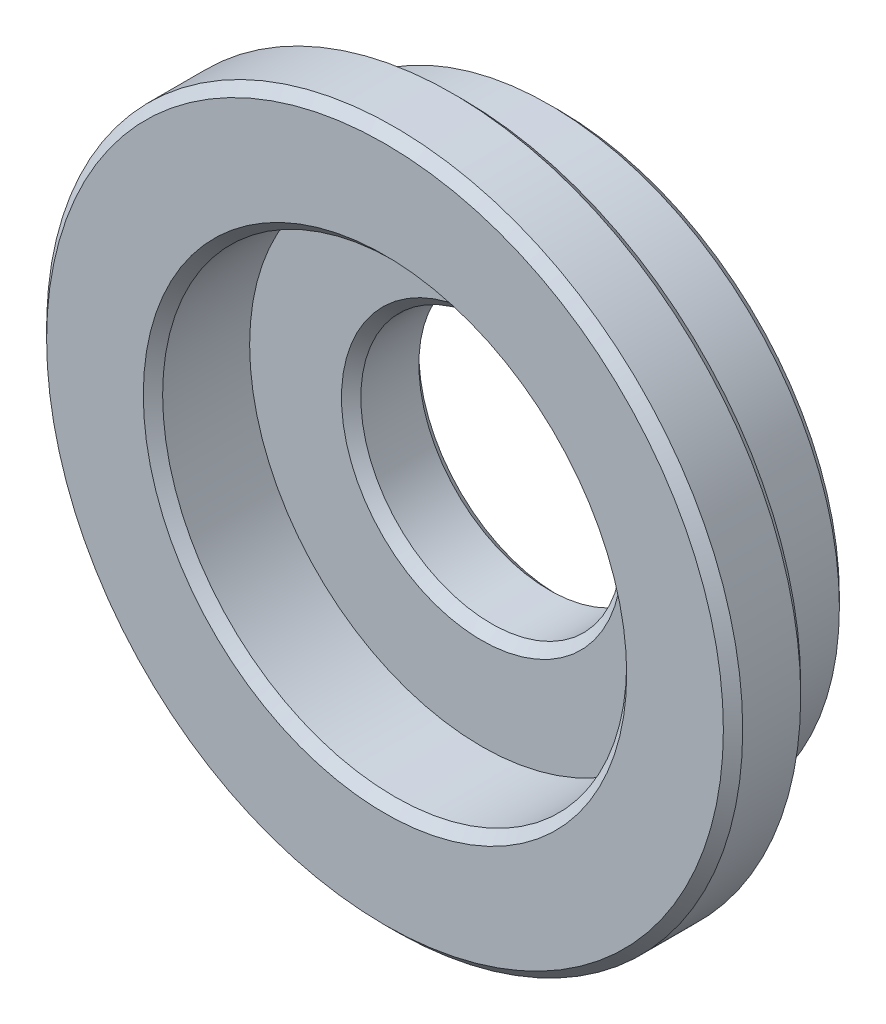
ISO-10303-21;
HEADER;
FILE_DESCRIPTION(('STEP AP214'),'2;1');
FILE_NAME('part.step','',(''),(''),'','','');
FILE_SCHEMA(('AUTOMOTIVE_DESIGN { 1 0 10303 214 1 1 1 1 }'));
ENDSEC;
DATA;
#1=APPLICATION_CONTEXT('core data for automotive mechanical design processes');
#2=APPLICATION_PROTOCOL_DEFINITION('international standard','automotive_design',2000,#1);
#3=PRODUCT_CONTEXT('',#1,'mechanical');
#4=PRODUCT('Part','Part','',(#3));
#5=PRODUCT_RELATED_PRODUCT_CATEGORY('part','',(#4));
#6=PRODUCT_DEFINITION_FORMATION('','',#4);
#7=PRODUCT_DEFINITION_CONTEXT('part definition',#1,'design');
#8=PRODUCT_DEFINITION('design','',#6,#7);
#9=PRODUCT_DEFINITION_SHAPE('','',#8);
#10=(LENGTH_UNIT() NAMED_UNIT(*) SI_UNIT(.MILLI.,.METRE.));
#11=(NAMED_UNIT(*) PLANE_ANGLE_UNIT() SI_UNIT($,.RADIAN.));
#12=(NAMED_UNIT(*) SI_UNIT($,.STERADIAN.) SOLID_ANGLE_UNIT());
#13=UNCERTAINTY_MEASURE_WITH_UNIT(LENGTH_MEASURE(1.E-05),#10,'distance_accuracy_value','');
#14=(GEOMETRIC_REPRESENTATION_CONTEXT(3) GLOBAL_UNCERTAINTY_ASSIGNED_CONTEXT((#13)) GLOBAL_UNIT_ASSIGNED_CONTEXT((#10,
#11,#12)) REPRESENTATION_CONTEXT('',''));
#15=CARTESIAN_POINT('',(0.,0.,0.));
#16=DIRECTION('',(0.,0.,1.));
#17=DIRECTION('',(1.,0.,0.));
#18=AXIS2_PLACEMENT_3D('',#15,#16,#17);
#19=CARTESIAN_POINT('',(0.,0.,0.699999999985221));
#20=DIRECTION('',(0.,0.,1.));
#21=DIRECTION('',(1.,0.,0.));
#22=AXIS2_PLACEMENT_3D('',#19,#20,#21);
#23=CONICAL_SURFACE('',#22,2.40000000000814,0.785398163397447);
#24=CARTESIAN_POINT('',(0.,0.,0.800000000025785));
#25=DIRECTION('',(0.,0.,1.));
#26=DIRECTION('',(1.,0.,0.));
#27=AXIS2_PLACEMENT_3D('',#24,#25,#26);
#28=CIRCLE('',#27,2.5000000000487);
#29=CARTESIAN_POINT('',(2.5000000000487,0.,0.800000000025785));
#30=VERTEX_POINT('',#29);
#31=EDGE_CURVE('E10',#30,#30,#28,.T.);
#32=ORIENTED_EDGE('',*,*,#31,.T.);
#33=EDGE_LOOP('',(#32));
#34=FACE_BOUND('',#33,.T.);
#35=CARTESIAN_POINT('',(0.,0.,0.699999999985221));
#36=DIRECTION('',(0.,0.,1.));
#37=DIRECTION('',(1.,0.,0.));
#38=AXIS2_PLACEMENT_3D('',#35,#36,#37);
#39=CIRCLE('',#38,2.40000000000814);
#40=CARTESIAN_POINT('',(2.40000000000814,0.,0.699999999985221));
#41=VERTEX_POINT('',#40);
#42=EDGE_CURVE('E79',#41,#41,#39,.T.);
#43=ORIENTED_EDGE('',*,*,#42,.F.);
#44=EDGE_LOOP('',(#43));
#45=FACE_BOUND('',#44,.T.);
#46=ADVANCED_FACE('F33',(#34,#45),#23,.F.);
#47=CARTESIAN_POINT('',(2.5000000000487,0.,0.800000000025785));
#48=DIRECTION('',(0.,0.,1.));
#49=DIRECTION('',(1.,0.,0.));
#50=AXIS2_PLACEMENT_3D('',#47,#48,#49);
#51=PLANE('',#50);
#52=CARTESIAN_POINT('',(0.,0.,0.800000000025785));
#53=DIRECTION('',(0.,0.,1.));
#54=DIRECTION('',(1.,0.,0.));
#55=AXIS2_PLACEMENT_3D('',#52,#53,#54);
#56=CIRCLE('',#55,3.49999999996821);
#57=CARTESIAN_POINT('',(3.49999999996821,0.,0.800000000025785));
#58=VERTEX_POINT('',#57);
#59=EDGE_CURVE('E39',#58,#58,#56,.T.);
#60=ORIENTED_EDGE('',*,*,#59,.T.);
#61=EDGE_LOOP('',(#60));
#62=FACE_BOUND('',#61,.T.);
#63=ORIENTED_EDGE('',*,*,#31,.F.);
#64=EDGE_LOOP('',(#63));
#65=FACE_BOUND('',#64,.T.);
#66=ADVANCED_FACE('F87',(#62,#65),#51,.T.);
#67=CARTESIAN_POINT('',(0.,0.,0.800000000025785));
#68=DIRECTION('',(0.,0.,-1.));
#69=DIRECTION('',(-1.,0.,0.));
#70=AXIS2_PLACEMENT_3D('',#67,#68,#69);
#71=CONICAL_SURFACE('',#70,3.49999999996821,0.785398163397449);
#72=CARTESIAN_POINT('',(0.,0.,0.699999999999546));
#73=DIRECTION('',(0.,0.,1.));
#74=DIRECTION('',(1.,0.,0.));
#75=AXIS2_PLACEMENT_3D('',#72,#73,#74);
#76=CIRCLE('',#75,3.59999999999445);
#77=CARTESIAN_POINT('',(3.59999999999445,0.,0.699999999999546));
#78=VERTEX_POINT('',#77);
#79=EDGE_CURVE('E43',#78,#78,#76,.T.);
#80=ORIENTED_EDGE('',*,*,#79,.T.);
#81=EDGE_LOOP('',(#80));
#82=FACE_BOUND('',#81,.T.);
#83=ORIENTED_EDGE('',*,*,#59,.F.);
#84=EDGE_LOOP('',(#83));
#85=FACE_BOUND('',#84,.T.);
#86=ADVANCED_FACE('F91',(#82,#85),#71,.T.);
#87=CARTESIAN_POINT('',(0.,0.,-1.));
#88=DIRECTION('',(0.,0.,1.));
#89=DIRECTION('',(1.,0.,0.));
#90=AXIS2_PLACEMENT_3D('',#87,#88,#89);
#91=CYLINDRICAL_SURFACE('',#90,3.59999999999445);
#92=CARTESIAN_POINT('',(0.,0.,0.100000000031287));
#93=DIRECTION('',(0.,0.,1.));
#94=DIRECTION('',(1.,0.,0.));
#95=AXIS2_PLACEMENT_3D('',#92,#93,#94);
#96=CIRCLE('',#95,3.59999999999445);
#97=CARTESIAN_POINT('',(3.59999999999445,0.,0.100000000031287));
#98=VERTEX_POINT('',#97);
#99=EDGE_CURVE('E47',#98,#98,#96,.T.);
#100=ORIENTED_EDGE('',*,*,#99,.T.);
#101=EDGE_LOOP('',(#100));
#102=FACE_BOUND('',#101,.T.);
#103=ORIENTED_EDGE('',*,*,#79,.F.);
#104=EDGE_LOOP('',(#103));
#105=FACE_BOUND('',#104,.T.);
#106=ADVANCED_FACE('F95',(#102,#105),#91,.T.);
#107=CARTESIAN_POINT('',(0.,0.,0.100000000031287));
#108=DIRECTION('',(0.,0.,1.));
#109=DIRECTION('',(1.,0.,0.));
#110=AXIS2_PLACEMENT_3D('',#107,#108,#109);
#111=CONICAL_SURFACE('',#110,3.59999999999445,0.785398163397448);
#112=CARTESIAN_POINT('',(0.,0.,2.79672118796981E-11));
#113=DIRECTION('',(0.,0.,1.));
#114=DIRECTION('',(1.,0.,0.));
#115=AXIS2_PLACEMENT_3D('',#112,#113,#114);
#116=CIRCLE('',#115,3.49999999999113);
#117=CARTESIAN_POINT('',(3.49999999999113,0.,2.79672118796981E-11));
#118=VERTEX_POINT('',#117);
#119=EDGE_CURVE('E52',#118,#118,#116,.T.);
#120=ORIENTED_EDGE('',*,*,#119,.T.);
#121=EDGE_LOOP('',(#120));
#122=FACE_BOUND('',#121,.T.);
#123=ORIENTED_EDGE('',*,*,#99,.F.);
#124=EDGE_LOOP('',(#123));
#125=FACE_BOUND('',#124,.T.);
#126=ADVANCED_FACE('F102',(#122,#125),#111,.T.);
#127=CARTESIAN_POINT('',(3.49999999999113,0.,2.79673291979469E-11));
#128=DIRECTION('',(0.,0.,-1.));
#129=DIRECTION('',(-1.,0.,0.));
#130=AXIS2_PLACEMENT_3D('',#127,#128,#129);
#131=PLANE('',#130);
#132=CARTESIAN_POINT('',(0.,0.,2.79674287201326E-11));
#133=DIRECTION('',(0.,0.,1.));
#134=DIRECTION('',(1.,0.,0.));
#135=AXIS2_PLACEMENT_3D('',#132,#133,#134);
#136=CIRCLE('',#135,3.00000000001214);
#137=CARTESIAN_POINT('',(3.00000000001214,0.,2.79674287201326E-11));
#138=VERTEX_POINT('',#137);
#139=EDGE_CURVE('E55',#138,#138,#136,.T.);
#140=ORIENTED_EDGE('',*,*,#139,.T.);
#141=EDGE_LOOP('',(#140));
#142=FACE_BOUND('',#141,.T.);
#143=ORIENTED_EDGE('',*,*,#119,.F.);
#144=EDGE_LOOP('',(#143));
#145=FACE_BOUND('',#144,.T.);
#146=ADVANCED_FACE('F106',(#142,#145),#131,.T.);
#147=CARTESIAN_POINT('',(0.,0.,-1.));
#148=DIRECTION('',(0.,0.,1.));
#149=DIRECTION('',(1.,0.,0.));
#150=AXIS2_PLACEMENT_3D('',#147,#148,#149);
#151=CYLINDRICAL_SURFACE('',#150,3.00000000001214);
#152=CARTESIAN_POINT('',(0.,0.,-0.899999999973034));
#153=DIRECTION('',(0.,0.,1.));
#154=DIRECTION('',(1.,0.,0.));
#155=AXIS2_PLACEMENT_3D('',#152,#153,#154);
#156=CIRCLE('',#155,3.00000000001214);
#157=CARTESIAN_POINT('',(3.00000000001214,0.,-0.899999999973034));
#158=VERTEX_POINT('',#157);
#159=EDGE_CURVE('E58',#158,#158,#156,.T.);
#160=ORIENTED_EDGE('',*,*,#159,.T.);
#161=EDGE_LOOP('',(#160));
#162=FACE_BOUND('',#161,.T.);
#163=ORIENTED_EDGE('',*,*,#139,.F.);
#164=EDGE_LOOP('',(#163));
#165=FACE_BOUND('',#164,.T.);
#166=ADVANCED_FACE('F110',(#162,#165),#151,.T.);
#167=CARTESIAN_POINT('',(0.,0.,-0.899999999973034));
#168=DIRECTION('',(0.,0.,1.));
#169=DIRECTION('',(1.,0.,0.));
#170=AXIS2_PLACEMENT_3D('',#167,#168,#169);
#171=CONICAL_SURFACE('',#170,3.00000000001214,0.785398163397449);
#172=CARTESIAN_POINT('',(0.,0.,-0.999999999976353));
#173=DIRECTION('',(0.,0.,1.));
#174=DIRECTION('',(1.,0.,0.));
#175=AXIS2_PLACEMENT_3D('',#172,#173,#174);
#176=CIRCLE('',#175,2.90000000000882);
#177=CARTESIAN_POINT('',(2.90000000000882,0.,-0.999999999976353));
#178=VERTEX_POINT('',#177);
#179=EDGE_CURVE('E61',#178,#178,#176,.T.);
#180=ORIENTED_EDGE('',*,*,#179,.T.);
#181=EDGE_LOOP('',(#180));
#182=FACE_BOUND('',#181,.T.);
#183=ORIENTED_EDGE('',*,*,#159,.F.);
#184=EDGE_LOOP('',(#183));
#185=FACE_BOUND('',#184,.T.);
#186=ADVANCED_FACE('F114',(#182,#185),#171,.T.);
#187=CARTESIAN_POINT('',(2.90000000000882,0.,-0.999999999976353));
#188=DIRECTION('',(0.,0.,-1.));
#189=DIRECTION('',(-1.,0.,0.));
#190=AXIS2_PLACEMENT_3D('',#187,#188,#189);
#191=PLANE('',#190);
#192=CARTESIAN_POINT('',(0.,0.,-0.999999999976353));
#193=DIRECTION('',(0.,0.,1.));
#194=DIRECTION('',(1.,0.,0.));
#195=AXIS2_PLACEMENT_3D('',#192,#193,#194);
#196=CIRCLE('',#195,1.4499999999749);
#197=CARTESIAN_POINT('',(1.4499999999749,0.,-0.999999999976353));
#198=VERTEX_POINT('',#197);
#199=EDGE_CURVE('E64',#198,#198,#196,.T.);
#200=ORIENTED_EDGE('',*,*,#199,.T.);
#201=EDGE_LOOP('',(#200));
#202=FACE_BOUND('',#201,.T.);
#203=ORIENTED_EDGE('',*,*,#179,.F.);
#204=EDGE_LOOP('',(#203));
#205=FACE_BOUND('',#204,.T.);
#206=ADVANCED_FACE('F118',(#202,#205),#191,.T.);
#207=CARTESIAN_POINT('',(0.,0.,-0.999999999976353));
#208=DIRECTION('',(0.,0.,-1.));
#209=DIRECTION('',(-1.,0.,0.));
#210=AXIS2_PLACEMENT_3D('',#207,#208,#209);
#211=CONICAL_SURFACE('',#210,1.4499999999749,0.785398163397448);
#212=CARTESIAN_POINT('',(0.,0.,-0.900000000001455));
#213=DIRECTION('',(0.,0.,1.));
#214=DIRECTION('',(1.,0.,0.));
#215=AXIS2_PLACEMENT_3D('',#212,#213,#214);
#216=CIRCLE('',#215,1.35);
#217=CARTESIAN_POINT('',(1.35,0.,-0.900000000001455));
#218=VERTEX_POINT('',#217);
#219=EDGE_CURVE('E67',#218,#218,#216,.T.);
#220=ORIENTED_EDGE('',*,*,#219,.T.);
#221=EDGE_LOOP('',(#220));
#222=FACE_BOUND('',#221,.T.);
#223=ORIENTED_EDGE('',*,*,#199,.F.);
#224=EDGE_LOOP('',(#223));
#225=FACE_BOUND('',#224,.T.);
#226=ADVANCED_FACE('F122',(#222,#225),#211,.F.);
#227=CARTESIAN_POINT('',(0.,0.,-1.));
#228=DIRECTION('',(0.,0.,1.));
#229=DIRECTION('',(1.,0.,0.));
#230=AXIS2_PLACEMENT_3D('',#227,#228,#229);
#231=CYLINDRICAL_SURFACE('',#230,1.35);
#232=CARTESIAN_POINT('',(0.,0.,-0.3));
#233=DIRECTION('',(0.,0.,1.));
#234=DIRECTION('',(1.,0.,0.));
#235=AXIS2_PLACEMENT_3D('',#232,#233,#234);
#236=CIRCLE('',#235,1.35);
#237=CARTESIAN_POINT('',(1.35,0.,-0.3));
#238=VERTEX_POINT('',#237);
#239=EDGE_CURVE('E70',#238,#238,#236,.T.);
#240=ORIENTED_EDGE('',*,*,#239,.T.);
#241=EDGE_LOOP('',(#240));
#242=FACE_BOUND('',#241,.T.);
#243=ORIENTED_EDGE('',*,*,#219,.F.);
#244=EDGE_LOOP('',(#243));
#245=FACE_BOUND('',#244,.T.);
#246=ADVANCED_FACE('F126',(#242,#245),#231,.F.);
#247=CARTESIAN_POINT('',(0.,0.,-0.3));
#248=DIRECTION('',(0.,0.,1.));
#249=DIRECTION('',(1.,0.,0.));
#250=AXIS2_PLACEMENT_3D('',#247,#248,#249);
#251=CONICAL_SURFACE('',#250,1.35,0.785398163397448);
#252=CARTESIAN_POINT('',(0.,0.,-0.200000000014779));
#253=DIRECTION('',(0.,0.,1.));
#254=DIRECTION('',(1.,0.,0.));
#255=AXIS2_PLACEMENT_3D('',#252,#253,#254);
#256=CIRCLE('',#255,1.44999999998522);
#257=CARTESIAN_POINT('',(1.44999999998522,0.,-0.200000000014779));
#258=VERTEX_POINT('',#257);
#259=EDGE_CURVE('E73',#258,#258,#256,.T.);
#260=ORIENTED_EDGE('',*,*,#259,.T.);
#261=EDGE_LOOP('',(#260));
#262=FACE_BOUND('',#261,.T.);
#263=ORIENTED_EDGE('',*,*,#239,.F.);
#264=EDGE_LOOP('',(#263));
#265=FACE_BOUND('',#264,.T.);
#266=ADVANCED_FACE('F130',(#262,#265),#251,.F.);
#267=CARTESIAN_POINT('',(1.44999999998522,0.,-0.200000000014779));
#268=DIRECTION('',(0.,0.,1.));
#269=DIRECTION('',(1.,0.,0.));
#270=AXIS2_PLACEMENT_3D('',#267,#268,#269);
#271=PLANE('',#270);
#272=CARTESIAN_POINT('',(0.,0.,-0.200000000014779));
#273=DIRECTION('',(0.,0.,1.));
#274=DIRECTION('',(1.,0.,0.));
#275=AXIS2_PLACEMENT_3D('',#272,#273,#274);
#276=CIRCLE('',#275,2.40000000000814);
#277=CARTESIAN_POINT('',(2.40000000000814,0.,-0.200000000014779));
#278=VERTEX_POINT('',#277);
#279=EDGE_CURVE('E76',#278,#278,#276,.T.);
#280=ORIENTED_EDGE('',*,*,#279,.T.);
#281=EDGE_LOOP('',(#280));
#282=FACE_BOUND('',#281,.T.);
#283=ORIENTED_EDGE('',*,*,#259,.F.);
#284=EDGE_LOOP('',(#283));
#285=FACE_BOUND('',#284,.T.);
#286=ADVANCED_FACE('F134',(#282,#285),#271,.T.);
#287=CARTESIAN_POINT('',(0.,0.,-1.));
#288=DIRECTION('',(0.,0.,1.));
#289=DIRECTION('',(1.,0.,0.));
#290=AXIS2_PLACEMENT_3D('',#287,#288,#289);
#291=CYLINDRICAL_SURFACE('',#290,2.40000000000814);
#292=ORIENTED_EDGE('',*,*,#42,.T.);
#293=EDGE_LOOP('',(#292));
#294=FACE_BOUND('',#293,.T.);
#295=ORIENTED_EDGE('',*,*,#279,.F.);
#296=EDGE_LOOP('',(#295));
#297=FACE_BOUND('',#296,.T.);
#298=ADVANCED_FACE('F83',(#294,#297),#291,.F.);
#299=CLOSED_SHELL('',(#46,#66,#86,#106,#126,#146,#166,#186,#206,#226,#246,#266,#286,#298));
#300=MANIFOLD_SOLID_BREP('B2',#299);
#301=ADVANCED_BREP_SHAPE_REPRESENTATION('',(#18,#300),#14);
#302=SHAPE_DEFINITION_REPRESENTATION(#9,#301);
ENDSEC;
END-ISO-10303-21;
